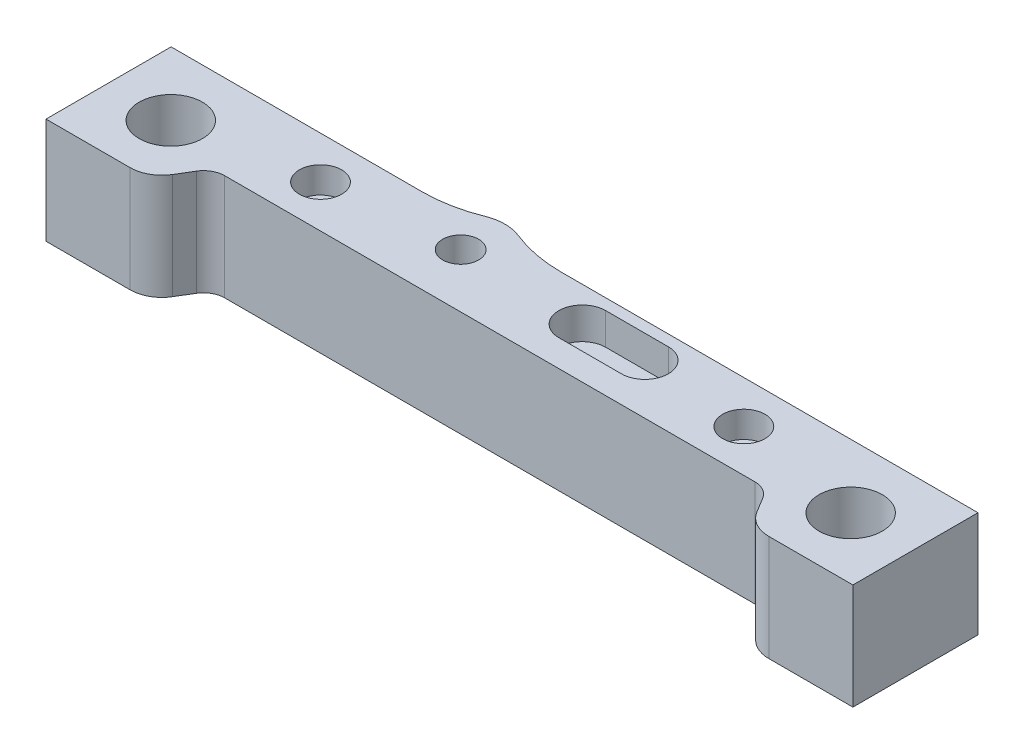
ISO-10303-21;
HEADER;
FILE_DESCRIPTION(('STEP AP214'),'2;1');
FILE_NAME('part.step','',(''),(''),'','','');
FILE_SCHEMA(('AUTOMOTIVE_DESIGN { 1 0 10303 214 1 1 1 1 }'));
ENDSEC;
DATA;
#1=APPLICATION_CONTEXT('core data for automotive mechanical design processes');
#2=APPLICATION_PROTOCOL_DEFINITION('international standard','automotive_design',2000,#1);
#3=PRODUCT_CONTEXT('',#1,'mechanical');
#4=PRODUCT('Part','Part','',(#3));
#5=PRODUCT_RELATED_PRODUCT_CATEGORY('part','',(#4));
#6=PRODUCT_DEFINITION_FORMATION('','',#4);
#7=PRODUCT_DEFINITION_CONTEXT('part definition',#1,'design');
#8=PRODUCT_DEFINITION('design','',#6,#7);
#9=PRODUCT_DEFINITION_SHAPE('','',#8);
#10=(LENGTH_UNIT() NAMED_UNIT(*) SI_UNIT(.MILLI.,.METRE.));
#11=(NAMED_UNIT(*) PLANE_ANGLE_UNIT() SI_UNIT($,.RADIAN.));
#12=(NAMED_UNIT(*) SI_UNIT($,.STERADIAN.) SOLID_ANGLE_UNIT());
#13=UNCERTAINTY_MEASURE_WITH_UNIT(LENGTH_MEASURE(1.E-05),#10,'distance_accuracy_value','');
#14=(GEOMETRIC_REPRESENTATION_CONTEXT(3) GLOBAL_UNCERTAINTY_ASSIGNED_CONTEXT((#13)) GLOBAL_UNIT_ASSIGNED_CONTEXT((#10,
#11,#12)) REPRESENTATION_CONTEXT('',''));
#15=CARTESIAN_POINT('',(0.,0.,0.));
#16=DIRECTION('',(0.,0.,1.));
#17=DIRECTION('',(1.,0.,0.));
#18=AXIS2_PLACEMENT_3D('',#15,#16,#17);
#19=CARTESIAN_POINT('',(20.,-13.5355339059327,-4.00499999999999));
#20=DIRECTION('',(0.,1.,0.));
#21=DIRECTION('',(0.,0.,1.));
#22=AXIS2_PLACEMENT_3D('',#19,#20,#21);
#23=CYLINDRICAL_SURFACE('',#22,1.25);
#24=CARTESIAN_POINT('',(20.,-2.48,-4.00499999999999));
#25=DIRECTION('',(0.,1.,0.));
#26=DIRECTION('',(0.,0.,1.));
#27=AXIS2_PLACEMENT_3D('',#24,#25,#26);
#28=CIRCLE('',#27,1.25);
#29=CARTESIAN_POINT('',(20.,-2.48,-2.75499999999999));
#30=VERTEX_POINT('',#29);
#31=EDGE_CURVE('E359',#30,#30,#28,.F.);
#32=ORIENTED_EDGE('',*,*,#31,.F.);
#33=EDGE_LOOP('',(#32));
#34=FACE_BOUND('',#33,.T.);
#35=CARTESIAN_POINT('',(20.,-7.2,-4.00499999999999));
#36=DIRECTION('',(0.,-1.,0.));
#37=DIRECTION('',(0.,0.,-1.));
#38=AXIS2_PLACEMENT_3D('',#35,#36,#37);
#39=CIRCLE('',#38,1.25);
#40=CARTESIAN_POINT('',(20.,-7.2,-5.25499999999999));
#41=VERTEX_POINT('',#40);
#42=EDGE_CURVE('E362',#41,#41,#39,.T.);
#43=ORIENTED_EDGE('',*,*,#42,.T.);
#44=EDGE_LOOP('',(#43));
#45=FACE_BOUND('',#44,.T.);
#46=ADVANCED_FACE('F38',(#34,#45),#23,.F.);
#47=CARTESIAN_POINT('',(0.,-10.,0.));
#48=DIRECTION('',(0.,1.,0.));
#49=DIRECTION('',(0.,0.,1.));
#50=AXIS2_PLACEMENT_3D('',#47,#48,#49);
#51=PLANE('',#50);
#52=CARTESIAN_POINT('',(20.,-10.,-4.00499999999999));
#53=DIRECTION('',(0.,-1.,0.));
#54=DIRECTION('',(0.,0.,-1.));
#55=AXIS2_PLACEMENT_3D('',#52,#53,#54);
#56=CIRCLE('',#55,2.725);
#57=CARTESIAN_POINT('',(20.,-10.,-6.72999999999999));
#58=VERTEX_POINT('',#57);
#59=EDGE_CURVE('E369',#58,#58,#56,.T.);
#60=ORIENTED_EDGE('',*,*,#59,.F.);
#61=EDGE_LOOP('',(#60));
#62=FACE_BOUND('',#61,.T.);
#63=CARTESIAN_POINT('',(-20.,-10.,-4.00499999999999));
#64=DIRECTION('',(0.,-1.,0.));
#65=DIRECTION('',(0.,0.,1.));
#66=AXIS2_PLACEMENT_3D('',#63,#64,#65);
#67=CIRCLE('',#66,2.725);
#68=CARTESIAN_POINT('',(-20.,-10.,-1.27999999999999));
#69=VERTEX_POINT('',#68);
#70=EDGE_CURVE('E374',#69,#69,#67,.T.);
#71=ORIENTED_EDGE('',*,*,#70,.F.);
#72=EDGE_LOOP('',(#71));
#73=FACE_BOUND('',#72,.T.);
#74=DIRECTION('',(-1.,0.,0.));
#75=VECTOR('',#74,1.);
#76=CARTESIAN_POINT('',(0.,-10.,3.80999999999997));
#77=LINE('',#76,#75);
#78=CARTESIAN_POINT('',(38.12,-10.,3.80999999999998));
#79=VERTEX_POINT('',#78);
#80=CARTESIAN_POINT('',(30.1715071075171,-10.,3.80999999999998));
#81=VERTEX_POINT('',#80);
#82=EDGE_CURVE('E263',#79,#81,#77,.T.);
#83=ORIENTED_EDGE('',*,*,#82,.T.);
#84=CARTESIAN_POINT('',(30.1715071075171,-10.,0.809999999999981));
#85=DIRECTION('',(0.,1.,0.));
#86=DIRECTION('',(0.,0.,1.));
#87=AXIS2_PLACEMENT_3D('',#84,#85,#86);
#88=CIRCLE('',#87,3.);
#89=CARTESIAN_POINT('',(27.6032012239419,-10.,2.36042087459919));
#90=VERTEX_POINT('',#89);
#91=EDGE_CURVE('E352',#81,#90,#88,.F.);
#92=ORIENTED_EDGE('',*,*,#91,.T.);
#93=DIRECTION('',(-0.516806958199737,0.,-0.856101961191735));
#94=VECTOR('',#93,1.);
#95=CARTESIAN_POINT('',(19.1863345718112,-10.,-11.5823017100173));
#96=LINE('',#95,#94);
#97=CARTESIAN_POINT('',(26.7616579117905,-10.,0.966386083600518));
#98=VERTEX_POINT('',#97);
#99=EDGE_CURVE('E261',#90,#98,#96,.T.);
#100=ORIENTED_EDGE('',*,*,#99,.T.);
#101=CARTESIAN_POINT('',(25.049453989407,-10.,1.99999999999999));
#102=DIRECTION('',(0.,1.,0.));
#103=DIRECTION('',(0.,0.,1.));
#104=AXIS2_PLACEMENT_3D('',#101,#102,#103);
#105=CIRCLE('',#104,2.);
#106=CARTESIAN_POINT('',(25.049453989407,-10.,0.));
#107=VERTEX_POINT('',#106);
#108=EDGE_CURVE('E336',#98,#107,#105,.T.);
#109=ORIENTED_EDGE('',*,*,#108,.T.);
#110=DIRECTION('',(-1.,0.,0.));
#111=VECTOR('',#110,1.);
#112=CARTESIAN_POINT('',(0.,-10.,0.));
#113=LINE('',#112,#111);
#114=CARTESIAN_POINT('',(-25.049453989407,-10.,0.));
#115=VERTEX_POINT('',#114);
#116=EDGE_CURVE('E258',#107,#115,#113,.T.);
#117=ORIENTED_EDGE('',*,*,#116,.T.);
#118=CARTESIAN_POINT('',(-25.049453989407,-10.,2.00000000000001));
#119=DIRECTION('',(0.,1.,0.));
#120=DIRECTION('',(0.,0.,1.));
#121=AXIS2_PLACEMENT_3D('',#118,#119,#120);
#122=CIRCLE('',#121,2.);
#123=CARTESIAN_POINT('',(-26.7616579117905,-10.,0.966386083600536));
#124=VERTEX_POINT('',#123);
#125=EDGE_CURVE('E340',#115,#124,#122,.T.);
#126=ORIENTED_EDGE('',*,*,#125,.T.);
#127=DIRECTION('',(-0.516806958199737,0.,0.856101961191735));
#128=VECTOR('',#127,1.);
#129=CARTESIAN_POINT('',(-19.1863345718112,-10.,-11.5823017100173));
#130=LINE('',#129,#128);
#131=CARTESIAN_POINT('',(-27.6032012239419,-10.,2.36042087459921));
#132=VERTEX_POINT('',#131);
#133=EDGE_CURVE('E256',#124,#132,#130,.T.);
#134=ORIENTED_EDGE('',*,*,#133,.T.);
#135=CARTESIAN_POINT('',(-30.1715071075171,-10.,0.809999999999999));
#136=DIRECTION('',(0.,1.,0.));
#137=DIRECTION('',(0.,0.,1.));
#138=AXIS2_PLACEMENT_3D('',#135,#136,#137);
#139=CIRCLE('',#138,3.);
#140=CARTESIAN_POINT('',(-30.1715071075171,-10.,3.81));
#141=VERTEX_POINT('',#140);
#142=EDGE_CURVE('E63',#132,#141,#139,.F.);
#143=ORIENTED_EDGE('',*,*,#142,.T.);
#144=DIRECTION('',(-1.,0.,0.));
#145=VECTOR('',#144,1.);
#146=CARTESIAN_POINT('',(0.,-10.,3.80999999999997));
#147=LINE('',#146,#145);
#148=CARTESIAN_POINT('',(-38.12,-10.,3.81000000000001));
#149=VERTEX_POINT('',#148);
#150=EDGE_CURVE('E254',#141,#149,#147,.T.);
#151=ORIENTED_EDGE('',*,*,#150,.T.);
#152=DIRECTION('',(0.,0.,-1.));
#153=VECTOR('',#152,1.);
#154=CARTESIAN_POINT('',(-38.12,-10.,0.));
#155=LINE('',#154,#153);
#156=CARTESIAN_POINT('',(-38.12,-10.,-8.01));
#157=VERTEX_POINT('',#156);
#158=EDGE_CURVE('E252',#149,#157,#155,.T.);
#159=ORIENTED_EDGE('',*,*,#158,.T.);
#160=DIRECTION('',(1.,0.,0.));
#161=VECTOR('',#160,1.);
#162=CARTESIAN_POINT('',(0.,-10.,-8.00999999999999));
#163=LINE('',#162,#161);
#164=CARTESIAN_POINT('',(-14.4092450938548,-10.,-8.00999999999999));
#165=VERTEX_POINT('',#164);
#166=EDGE_CURVE('E250',#157,#165,#163,.T.);
#167=ORIENTED_EDGE('',*,*,#166,.T.);
#168=CARTESIAN_POINT('',(-14.4092450938548,-10.,-21.4073898813991));
#169=DIRECTION('',(0.,1.,0.));
#170=DIRECTION('',(0.,0.,1.));
#171=AXIS2_PLACEMENT_3D('',#168,#169,#170);
#172=CIRCLE('',#171,13.3973898813991);
#173=CARTESIAN_POINT('',(-9.40924509385477,-10.,-8.97798701423709));
#174=VERTEX_POINT('',#173);
#175=EDGE_CURVE('E246',#174,#165,#172,.F.);
#176=ORIENTED_EDGE('',*,*,#175,.F.);
#177=CARTESIAN_POINT('',(-7.84923973572024,-10.,-5.09999999999999));
#178=DIRECTION('',(0.,1.,0.));
#179=DIRECTION('',(0.,0.,1.));
#180=AXIS2_PLACEMENT_3D('',#177,#178,#179);
#181=CIRCLE('',#180,4.18);
#182=CARTESIAN_POINT('',(-6.2892343775857,-10.,-8.97798701423709));
#183=VERTEX_POINT('',#182);
#184=EDGE_CURVE('E243',#174,#183,#181,.F.);
#185=ORIENTED_EDGE('',*,*,#184,.T.);
#186=CARTESIAN_POINT('',(-1.28923437758571,-10.,-21.4073898813991));
#187=DIRECTION('',(0.,1.,0.));
#188=DIRECTION('',(0.,0.,1.));
#189=AXIS2_PLACEMENT_3D('',#186,#187,#188);
#190=CIRCLE('',#189,13.3973898813991);
#191=CARTESIAN_POINT('',(-1.28923437758571,-10.,-8.00999999999999));
#192=VERTEX_POINT('',#191);
#193=EDGE_CURVE('E270',#183,#192,#190,.T.);
#194=ORIENTED_EDGE('',*,*,#193,.T.);
#195=DIRECTION('',(1.,0.,0.));
#196=VECTOR('',#195,1.);
#197=CARTESIAN_POINT('',(0.,-10.,-8.00999999999999));
#198=LINE('',#197,#196);
#199=CARTESIAN_POINT('',(38.12,-10.,-8.01000000000002));
#200=VERTEX_POINT('',#199);
#201=EDGE_CURVE('E268',#192,#200,#198,.T.);
#202=ORIENTED_EDGE('',*,*,#201,.T.);
#203=DIRECTION('',(0.,0.,1.));
#204=VECTOR('',#203,1.);
#205=CARTESIAN_POINT('',(38.12,-10.,0.));
#206=LINE('',#205,#204);
#207=EDGE_CURVE('E266',#200,#79,#206,.T.);
#208=ORIENTED_EDGE('',*,*,#207,.T.);
#209=EDGE_LOOP('',(#83,#92,#100,#109,#117,#126,#134,#143,#151,#159,#167,#176,#185,#194,#202,#208));
#210=FACE_BOUND('',#209,.T.);
#211=CARTESIAN_POINT('',(-7.84923973572024,-10.,-5.09999999999999));
#212=DIRECTION('',(0.,1.,0.));
#213=DIRECTION('',(0.,0.,1.));
#214=AXIS2_PLACEMENT_3D('',#211,#212,#213);
#215=CIRCLE('',#214,1.7);
#216=CARTESIAN_POINT('',(-7.84923973572024,-10.,-3.39999999999999));
#217=VERTEX_POINT('',#216);
#218=EDGE_CURVE('E203',#217,#217,#215,.F.);
#219=ORIENTED_EDGE('',*,*,#218,.F.);
#220=EDGE_LOOP('',(#219));
#221=FACE_BOUND('',#220,.T.);
#222=ADVANCED_FACE('F389',(#62,#73,#210,#221),#51,.F.);
#223=CARTESIAN_POINT('',(0.,0.,0.));
#224=DIRECTION('',(0.,1.,0.));
#225=DIRECTION('',(0.,0.,1.));
#226=AXIS2_PLACEMENT_3D('',#223,#224,#225);
#227=PLANE('',#226);
#228=CARTESIAN_POINT('',(-7.84923973572024,0.,-5.09999999999999));
#229=DIRECTION('',(0.,1.,0.));
#230=DIRECTION('',(0.,0.,1.));
#231=AXIS2_PLACEMENT_3D('',#228,#229,#230);
#232=CIRCLE('',#231,1.7);
#233=CARTESIAN_POINT('',(-7.84923973572024,0.,-3.39999999999999));
#234=VERTEX_POINT('',#233);
#235=EDGE_CURVE('E361',#234,#234,#232,.T.);
#236=ORIENTED_EDGE('',*,*,#235,.F.);
#237=EDGE_LOOP('',(#236));
#238=FACE_BOUND('',#237,.T.);
#239=DIRECTION('',(1.,0.,0.));
#240=VECTOR('',#239,1.);
#241=CARTESIAN_POINT('',(0.,0.,-2.52999999999999));
#242=LINE('',#241,#240);
#243=CARTESIAN_POINT('',(3.99210502631991,0.,-2.52999999999999));
#244=VERTEX_POINT('',#243);
#245=CARTESIAN_POINT('',(9.91210502631991,0.,-2.52999999999999));
#246=VERTEX_POINT('',#245);
#247=EDGE_CURVE('E55',#244,#246,#242,.T.);
#248=ORIENTED_EDGE('',*,*,#247,.F.);
#249=CARTESIAN_POINT('',(3.99210502631991,0.,-4.74499999999999));
#250=DIRECTION('',(0.,1.,0.));
#251=DIRECTION('',(0.,0.,1.));
#252=AXIS2_PLACEMENT_3D('',#249,#250,#251);
#253=CIRCLE('',#252,2.215);
#254=CARTESIAN_POINT('',(3.99210502631991,0.,-6.95999999999999));
#255=VERTEX_POINT('',#254);
#256=EDGE_CURVE('E197',#255,#244,#253,.T.);
#257=ORIENTED_EDGE('',*,*,#256,.F.);
#258=DIRECTION('',(1.,0.,0.));
#259=VECTOR('',#258,1.);
#260=CARTESIAN_POINT('',(0.,0.,-6.95999999999999));
#261=LINE('',#260,#259);
#262=CARTESIAN_POINT('',(9.91210502631991,0.,-6.95999999999999));
#263=VERTEX_POINT('',#262);
#264=EDGE_CURVE('E200',#255,#263,#261,.T.);
#265=ORIENTED_EDGE('',*,*,#264,.T.);
#266=CARTESIAN_POINT('',(9.91210502631991,0.,-4.74499999999999));
#267=DIRECTION('',(0.,1.,0.));
#268=DIRECTION('',(0.,0.,1.));
#269=AXIS2_PLACEMENT_3D('',#266,#267,#268);
#270=CIRCLE('',#269,2.215);
#271=EDGE_CURVE('E209',#246,#263,#270,.T.);
#272=ORIENTED_EDGE('',*,*,#271,.F.);
#273=EDGE_LOOP('',(#248,#257,#265,#272));
#274=FACE_BOUND('',#273,.T.);
#275=CARTESIAN_POINT('',(20.,0.,-4.00499999999999));
#276=DIRECTION('',(0.,1.,0.));
#277=DIRECTION('',(0.,0.,1.));
#278=AXIS2_PLACEMENT_3D('',#275,#276,#277);
#279=CIRCLE('',#278,2.);
#280=CARTESIAN_POINT('',(20.,0.,-2.00499999999999));
#281=VERTEX_POINT('',#280);
#282=EDGE_CURVE('E215',#281,#281,#279,.F.);
#283=ORIENTED_EDGE('',*,*,#282,.T.);
#284=EDGE_LOOP('',(#283));
#285=FACE_BOUND('',#284,.T.);
#286=DIRECTION('',(-0.516806958199737,0.,-0.856101961191735));
#287=VECTOR('',#286,1.);
#288=CARTESIAN_POINT('',(19.1863345718112,0.,-11.5823017100173));
#289=LINE('',#288,#287);
#290=CARTESIAN_POINT('',(27.6032012239419,0.,2.36042087459919));
#291=VERTEX_POINT('',#290);
#292=CARTESIAN_POINT('',(26.7616579117905,0.,0.966386083600518));
#293=VERTEX_POINT('',#292);
#294=EDGE_CURVE('E291',#291,#293,#289,.T.);
#295=ORIENTED_EDGE('',*,*,#294,.F.);
#296=CARTESIAN_POINT('',(30.1715071075171,0.,0.809999999999981));
#297=DIRECTION('',(0.,1.,0.));
#298=DIRECTION('',(0.,0.,1.));
#299=AXIS2_PLACEMENT_3D('',#296,#297,#298);
#300=CIRCLE('',#299,3.);
#301=CARTESIAN_POINT('',(30.1715071075171,0.,3.80999999999998));
#302=VERTEX_POINT('',#301);
#303=EDGE_CURVE('E347',#291,#302,#300,.T.);
#304=ORIENTED_EDGE('',*,*,#303,.T.);
#305=DIRECTION('',(-1.,0.,0.));
#306=VECTOR('',#305,1.);
#307=CARTESIAN_POINT('',(0.,0.,3.80999999999997));
#308=LINE('',#307,#306);
#309=CARTESIAN_POINT('',(38.12,0.,3.80999999999998));
#310=VERTEX_POINT('',#309);
#311=EDGE_CURVE('E293',#310,#302,#308,.T.);
#312=ORIENTED_EDGE('',*,*,#311,.F.);
#313=DIRECTION('',(0.,0.,1.));
#314=VECTOR('',#313,1.);
#315=CARTESIAN_POINT('',(38.12,0.,0.));
#316=LINE('',#315,#314);
#317=CARTESIAN_POINT('',(38.12,0.,-8.01000000000002));
#318=VERTEX_POINT('',#317);
#319=EDGE_CURVE('E296',#318,#310,#316,.T.);
#320=ORIENTED_EDGE('',*,*,#319,.F.);
#321=DIRECTION('',(1.,0.,0.));
#322=VECTOR('',#321,1.);
#323=CARTESIAN_POINT('',(0.,0.,-8.00999999999999));
#324=LINE('',#323,#322);
#325=CARTESIAN_POINT('',(-1.28923437758571,0.,-8.00999999999999));
#326=VERTEX_POINT('',#325);
#327=EDGE_CURVE('E298',#326,#318,#324,.T.);
#328=ORIENTED_EDGE('',*,*,#327,.F.);
#329=CARTESIAN_POINT('',(-1.28923437758571,0.,-21.4073898813991));
#330=DIRECTION('',(0.,1.,0.));
#331=DIRECTION('',(0.,0.,1.));
#332=AXIS2_PLACEMENT_3D('',#329,#330,#331);
#333=CIRCLE('',#332,13.3973898813991);
#334=CARTESIAN_POINT('',(-6.2892343775857,0.,-8.97798701423709));
#335=VERTEX_POINT('',#334);
#336=EDGE_CURVE('E247',#335,#326,#333,.T.);
#337=ORIENTED_EDGE('',*,*,#336,.F.);
#338=CARTESIAN_POINT('',(-7.84923973572024,0.,-5.09999999999999));
#339=DIRECTION('',(0.,1.,0.));
#340=DIRECTION('',(0.,0.,1.));
#341=AXIS2_PLACEMENT_3D('',#338,#339,#340);
#342=CIRCLE('',#341,4.18);
#343=CARTESIAN_POINT('',(-9.40924509385477,0.,-8.97798701423709));
#344=VERTEX_POINT('',#343);
#345=EDGE_CURVE('E234',#344,#335,#342,.F.);
#346=ORIENTED_EDGE('',*,*,#345,.F.);
#347=CARTESIAN_POINT('',(-14.4092450938548,0.,-21.4073898813991));
#348=DIRECTION('',(0.,1.,0.));
#349=DIRECTION('',(0.,0.,1.));
#350=AXIS2_PLACEMENT_3D('',#347,#348,#349);
#351=CIRCLE('',#350,13.3973898813991);
#352=CARTESIAN_POINT('',(-14.4092450938548,0.,-8.00999999999999));
#353=VERTEX_POINT('',#352);
#354=EDGE_CURVE('E275',#344,#353,#351,.F.);
#355=ORIENTED_EDGE('',*,*,#354,.T.);
#356=DIRECTION('',(1.,0.,0.));
#357=VECTOR('',#356,1.);
#358=CARTESIAN_POINT('',(0.,0.,-8.00999999999999));
#359=LINE('',#358,#357);
#360=CARTESIAN_POINT('',(-38.12,0.,-8.01));
#361=VERTEX_POINT('',#360);
#362=EDGE_CURVE('E278',#361,#353,#359,.T.);
#363=ORIENTED_EDGE('',*,*,#362,.F.);
#364=DIRECTION('',(0.,0.,-1.));
#365=VECTOR('',#364,1.);
#366=CARTESIAN_POINT('',(-38.12,0.,0.));
#367=LINE('',#366,#365);
#368=CARTESIAN_POINT('',(-38.12,0.,3.81000000000001));
#369=VERTEX_POINT('',#368);
#370=EDGE_CURVE('E281',#369,#361,#367,.T.);
#371=ORIENTED_EDGE('',*,*,#370,.F.);
#372=DIRECTION('',(-1.,0.,0.));
#373=VECTOR('',#372,1.);
#374=CARTESIAN_POINT('',(0.,0.,3.80999999999997));
#375=LINE('',#374,#373);
#376=CARTESIAN_POINT('',(-30.1715071075171,0.,3.81));
#377=VERTEX_POINT('',#376);
#378=EDGE_CURVE('E283',#377,#369,#375,.T.);
#379=ORIENTED_EDGE('',*,*,#378,.F.);
#380=CARTESIAN_POINT('',(-30.1715071075171,0.,0.809999999999999));
#381=DIRECTION('',(0.,1.,0.));
#382=DIRECTION('',(0.,0.,1.));
#383=AXIS2_PLACEMENT_3D('',#380,#381,#382);
#384=CIRCLE('',#383,3.);
#385=CARTESIAN_POINT('',(-27.6032012239419,0.,2.36042087459921));
#386=VERTEX_POINT('',#385);
#387=EDGE_CURVE('E345',#377,#386,#384,.T.);
#388=ORIENTED_EDGE('',*,*,#387,.T.);
#389=DIRECTION('',(-0.516806958199737,0.,0.856101961191735));
#390=VECTOR('',#389,1.);
#391=CARTESIAN_POINT('',(-19.1863345718112,0.,-11.5823017100173));
#392=LINE('',#391,#390);
#393=CARTESIAN_POINT('',(-26.7616579117905,0.,0.966386083600536));
#394=VERTEX_POINT('',#393);
#395=EDGE_CURVE('E285',#394,#386,#392,.T.);
#396=ORIENTED_EDGE('',*,*,#395,.F.);
#397=CARTESIAN_POINT('',(-25.049453989407,0.,2.00000000000001));
#398=DIRECTION('',(0.,1.,0.));
#399=DIRECTION('',(0.,0.,1.));
#400=AXIS2_PLACEMENT_3D('',#397,#398,#399);
#401=CIRCLE('',#400,2.);
#402=CARTESIAN_POINT('',(-25.049453989407,0.,0.));
#403=VERTEX_POINT('',#402);
#404=EDGE_CURVE('E338',#394,#403,#401,.F.);
#405=ORIENTED_EDGE('',*,*,#404,.T.);
#406=DIRECTION('',(-1.,0.,0.));
#407=VECTOR('',#406,1.);
#408=CARTESIAN_POINT('',(0.,0.,0.));
#409=LINE('',#408,#407);
#410=CARTESIAN_POINT('',(25.049453989407,0.,0.));
#411=VERTEX_POINT('',#410);
#412=EDGE_CURVE('E288',#411,#403,#409,.T.);
#413=ORIENTED_EDGE('',*,*,#412,.F.);
#414=CARTESIAN_POINT('',(25.049453989407,0.,1.99999999999999));
#415=DIRECTION('',(0.,1.,0.));
#416=DIRECTION('',(0.,0.,1.));
#417=AXIS2_PLACEMENT_3D('',#414,#415,#416);
#418=CIRCLE('',#417,2.);
#419=EDGE_CURVE('E333',#411,#293,#418,.F.);
#420=ORIENTED_EDGE('',*,*,#419,.T.);
#421=EDGE_LOOP('',(#295,#304,#312,#320,#328,#337,#346,#355,#363,#371,#379,#388,#396,#405,#413,#420));
#422=FACE_BOUND('',#421,.T.);
#423=CARTESIAN_POINT('',(-32.12,0.,-1.98));
#424=DIRECTION('',(0.,1.,0.));
#425=DIRECTION('',(0.,0.,1.));
#426=AXIS2_PLACEMENT_3D('',#423,#424,#425);
#427=CIRCLE('',#426,2.99);
#428=CARTESIAN_POINT('',(-32.12,0.,1.01));
#429=VERTEX_POINT('',#428);
#430=EDGE_CURVE('E238',#429,#429,#427,.T.);
#431=ORIENTED_EDGE('',*,*,#430,.F.);
#432=EDGE_LOOP('',(#431));
#433=FACE_BOUND('',#432,.T.);
#434=CARTESIAN_POINT('',(32.12,0.,-1.98));
#435=DIRECTION('',(0.,1.,0.));
#436=DIRECTION('',(0.,0.,1.));
#437=AXIS2_PLACEMENT_3D('',#434,#435,#436);
#438=CIRCLE('',#437,2.99);
#439=CARTESIAN_POINT('',(32.12,0.,1.01));
#440=VERTEX_POINT('',#439);
#441=EDGE_CURVE('E235',#440,#440,#438,.F.);
#442=ORIENTED_EDGE('',*,*,#441,.T.);
#443=EDGE_LOOP('',(#442));
#444=FACE_BOUND('',#443,.T.);
#445=CARTESIAN_POINT('',(-20.,0.,-4.00499999999999));
#446=DIRECTION('',(0.,1.,0.));
#447=DIRECTION('',(0.,0.,1.));
#448=AXIS2_PLACEMENT_3D('',#445,#446,#447);
#449=CIRCLE('',#448,2.);
#450=CARTESIAN_POINT('',(-20.,0.,-2.00499999999999));
#451=VERTEX_POINT('',#450);
#452=EDGE_CURVE('E223',#451,#451,#449,.T.);
#453=ORIENTED_EDGE('',*,*,#452,.F.);
#454=EDGE_LOOP('',(#453));
#455=FACE_BOUND('',#454,.T.);
#456=ADVANCED_FACE('F391',(#238,#274,#285,#422,#433,#444,#455),#227,.T.);
#457=CARTESIAN_POINT('',(-7.84923973572024,-10.,-5.09999999999999));
#458=DIRECTION('',(0.,1.,0.));
#459=DIRECTION('',(0.,0.,1.));
#460=AXIS2_PLACEMENT_3D('',#457,#458,#459);
#461=CYLINDRICAL_SURFACE('',#460,4.18);
#462=ORIENTED_EDGE('',*,*,#345,.T.);
#463=DIRECTION('',(0.,1.,0.));
#464=VECTOR('',#463,1.);
#465=CARTESIAN_POINT('',(-6.2892343775857,-10.,-8.97798701423709));
#466=LINE('',#465,#464);
#467=EDGE_CURVE('E301',#183,#335,#466,.T.);
#468=ORIENTED_EDGE('',*,*,#467,.F.);
#469=ORIENTED_EDGE('',*,*,#184,.F.);
#470=DIRECTION('',(0.,1.,0.));
#471=VECTOR('',#470,1.);
#472=CARTESIAN_POINT('',(-9.40924509385477,-10.,-8.97798701423709));
#473=LINE('',#472,#471);
#474=EDGE_CURVE('E272',#174,#344,#473,.T.);
#475=ORIENTED_EDGE('',*,*,#474,.T.);
#476=EDGE_LOOP('',(#462,#468,#469,#475));
#477=FACE_BOUND('',#476,.T.);
#478=ADVANCED_FACE('F398',(#477),#461,.T.);
#479=CARTESIAN_POINT('',(-1.28923437758571,-10.,-21.4073898813991));
#480=DIRECTION('',(0.,1.,0.));
#481=DIRECTION('',(0.,0.,1.));
#482=AXIS2_PLACEMENT_3D('',#479,#480,#481);
#483=CYLINDRICAL_SURFACE('',#482,13.3973898813991);
#484=ORIENTED_EDGE('',*,*,#336,.T.);
#485=DIRECTION('',(0.,1.,0.));
#486=VECTOR('',#485,1.);
#487=CARTESIAN_POINT('',(-1.28923437758571,-10.,-8.00999999999999));
#488=LINE('',#487,#486);
#489=EDGE_CURVE('E305',#192,#326,#488,.T.);
#490=ORIENTED_EDGE('',*,*,#489,.F.);
#491=ORIENTED_EDGE('',*,*,#193,.F.);
#492=ORIENTED_EDGE('',*,*,#467,.T.);
#493=EDGE_LOOP('',(#484,#490,#491,#492));
#494=FACE_BOUND('',#493,.T.);
#495=ADVANCED_FACE('F409',(#494),#483,.F.);
#496=CARTESIAN_POINT('',(0.,-10.,-8.00999999999999));
#497=DIRECTION('',(0.,0.,1.));
#498=DIRECTION('',(1.,0.,0.));
#499=AXIS2_PLACEMENT_3D('',#496,#497,#498);
#500=PLANE('',#499);
#501=ORIENTED_EDGE('',*,*,#327,.T.);
#502=DIRECTION('',(0.,1.,0.));
#503=VECTOR('',#502,1.);
#504=CARTESIAN_POINT('',(38.12,-10.,-8.01000000000002));
#505=LINE('',#504,#503);
#506=EDGE_CURVE('E308',#200,#318,#505,.T.);
#507=ORIENTED_EDGE('',*,*,#506,.F.);
#508=ORIENTED_EDGE('',*,*,#201,.F.);
#509=ORIENTED_EDGE('',*,*,#489,.T.);
#510=EDGE_LOOP('',(#501,#507,#508,#509));
#511=FACE_BOUND('',#510,.T.);
#512=ADVANCED_FACE('F412',(#511),#500,.F.);
#513=CARTESIAN_POINT('',(38.12,-10.,0.));
#514=DIRECTION('',(-1.,0.,0.));
#515=DIRECTION('',(0.,0.,1.));
#516=AXIS2_PLACEMENT_3D('',#513,#514,#515);
#517=PLANE('',#516);
#518=ORIENTED_EDGE('',*,*,#319,.T.);
#519=DIRECTION('',(0.,1.,0.));
#520=VECTOR('',#519,1.);
#521=CARTESIAN_POINT('',(38.12,-10.,3.80999999999998));
#522=LINE('',#521,#520);
#523=EDGE_CURVE('E311',#79,#310,#522,.T.);
#524=ORIENTED_EDGE('',*,*,#523,.F.);
#525=ORIENTED_EDGE('',*,*,#207,.F.);
#526=ORIENTED_EDGE('',*,*,#506,.T.);
#527=EDGE_LOOP('',(#518,#524,#525,#526));
#528=FACE_BOUND('',#527,.T.);
#529=ADVANCED_FACE('F416',(#528),#517,.F.);
#530=CARTESIAN_POINT('',(0.,-10.,3.80999999999997));
#531=DIRECTION('',(0.,0.,-1.));
#532=DIRECTION('',(-1.,0.,0.));
#533=AXIS2_PLACEMENT_3D('',#530,#531,#532);
#534=PLANE('',#533);
#535=ORIENTED_EDGE('',*,*,#311,.T.);
#536=DIRECTION('',(0.,1.,0.));
#537=VECTOR('',#536,1.);
#538=CARTESIAN_POINT('',(30.1715071075171,-10.,3.80999999999998));
#539=LINE('',#538,#537);
#540=EDGE_CURVE('E349',#302,#81,#539,.F.);
#541=ORIENTED_EDGE('',*,*,#540,.T.);
#542=ORIENTED_EDGE('',*,*,#82,.F.);
#543=ORIENTED_EDGE('',*,*,#523,.T.);
#544=EDGE_LOOP('',(#535,#541,#542,#543));
#545=FACE_BOUND('',#544,.T.);
#546=ADVANCED_FACE('F420',(#545),#534,.F.);
#547=CARTESIAN_POINT('',(19.1863345718112,-10.,-11.5823017100173));
#548=DIRECTION('',(0.856101961191735,0.,-0.516806958199737));
#549=DIRECTION('',(-0.516806958199737,0.,-0.856101961191735));
#550=AXIS2_PLACEMENT_3D('',#547,#548,#549);
#551=PLANE('',#550);
#552=ORIENTED_EDGE('',*,*,#99,.F.);
#553=DIRECTION('',(0.,1.,0.));
#554=VECTOR('',#553,1.);
#555=CARTESIAN_POINT('',(27.6032012239419,-10.,2.36042087459919));
#556=LINE('',#555,#554);
#557=EDGE_CURVE('E342',#90,#291,#556,.T.);
#558=ORIENTED_EDGE('',*,*,#557,.T.);
#559=ORIENTED_EDGE('',*,*,#294,.T.);
#560=DIRECTION('',(0.,1.,0.));
#561=VECTOR('',#560,1.);
#562=CARTESIAN_POINT('',(26.7616579117905,-10.,0.96638608360052));
#563=LINE('',#562,#561);
#564=EDGE_CURVE('E327',#293,#98,#563,.F.);
#565=ORIENTED_EDGE('',*,*,#564,.T.);
#566=EDGE_LOOP('',(#552,#558,#559,#565));
#567=FACE_BOUND('',#566,.T.);
#568=ADVANCED_FACE('F424',(#567),#551,.F.);
#569=CARTESIAN_POINT('',(0.,-10.,0.));
#570=DIRECTION('',(0.,0.,-1.));
#571=DIRECTION('',(-1.,0.,0.));
#572=AXIS2_PLACEMENT_3D('',#569,#570,#571);
#573=PLANE('',#572);
#574=ORIENTED_EDGE('',*,*,#116,.F.);
#575=DIRECTION('',(0.,1.,0.));
#576=VECTOR('',#575,1.);
#577=CARTESIAN_POINT('',(25.049453989407,0.,0.));
#578=LINE('',#577,#576);
#579=EDGE_CURVE('E324',#107,#411,#578,.T.);
#580=ORIENTED_EDGE('',*,*,#579,.T.);
#581=ORIENTED_EDGE('',*,*,#412,.T.);
#582=DIRECTION('',(0.,1.,0.));
#583=VECTOR('',#582,1.);
#584=CARTESIAN_POINT('',(-25.049453989407,-10.,0.));
#585=LINE('',#584,#583);
#586=EDGE_CURVE('E304',#403,#115,#585,.F.);
#587=ORIENTED_EDGE('',*,*,#586,.T.);
#588=EDGE_LOOP('',(#574,#580,#581,#587));
#589=FACE_BOUND('',#588,.T.);
#590=ADVANCED_FACE('F428',(#589),#573,.F.);
#591=CARTESIAN_POINT('',(-19.1863345718112,-10.,-11.5823017100173));
#592=DIRECTION('',(-0.856101961191735,0.,-0.516806958199737));
#593=DIRECTION('',(-0.516806958199737,0.,0.856101961191735));
#594=AXIS2_PLACEMENT_3D('',#591,#592,#593);
#595=PLANE('',#594);
#596=ORIENTED_EDGE('',*,*,#395,.T.);
#597=DIRECTION('',(0.,1.,0.));
#598=VECTOR('',#597,1.);
#599=CARTESIAN_POINT('',(-27.6032012239419,-10.,2.36042087459921));
#600=LINE('',#599,#598);
#601=EDGE_CURVE('E11',#386,#132,#600,.F.);
#602=ORIENTED_EDGE('',*,*,#601,.T.);
#603=ORIENTED_EDGE('',*,*,#133,.F.);
#604=DIRECTION('',(0.,1.,0.));
#605=VECTOR('',#604,1.);
#606=CARTESIAN_POINT('',(-26.7616579117905,0.,0.966386083600533));
#607=LINE('',#606,#605);
#608=EDGE_CURVE('E330',#124,#394,#607,.T.);
#609=ORIENTED_EDGE('',*,*,#608,.T.);
#610=EDGE_LOOP('',(#596,#602,#603,#609));
#611=FACE_BOUND('',#610,.T.);
#612=ADVANCED_FACE('F432',(#611),#595,.F.);
#613=CARTESIAN_POINT('',(0.,-10.,3.80999999999997));
#614=DIRECTION('',(0.,0.,-1.));
#615=DIRECTION('',(-1.,0.,0.));
#616=AXIS2_PLACEMENT_3D('',#613,#614,#615);
#617=PLANE('',#616);
#618=ORIENTED_EDGE('',*,*,#150,.F.);
#619=DIRECTION('',(0.,1.,0.));
#620=VECTOR('',#619,1.);
#621=CARTESIAN_POINT('',(-30.1715071075171,-10.,3.81));
#622=LINE('',#621,#620);
#623=EDGE_CURVE('E47',#141,#377,#622,.T.);
#624=ORIENTED_EDGE('',*,*,#623,.T.);
#625=ORIENTED_EDGE('',*,*,#378,.T.);
#626=DIRECTION('',(0.,1.,0.));
#627=VECTOR('',#626,1.);
#628=CARTESIAN_POINT('',(-38.12,-10.,3.81000000000001));
#629=LINE('',#628,#627);
#630=EDGE_CURVE('E314',#149,#369,#629,.T.);
#631=ORIENTED_EDGE('',*,*,#630,.F.);
#632=EDGE_LOOP('',(#618,#624,#625,#631));
#633=FACE_BOUND('',#632,.T.);
#634=ADVANCED_FACE('F436',(#633),#617,.F.);
#635=CARTESIAN_POINT('',(-38.12,-10.,0.));
#636=DIRECTION('',(1.,0.,0.));
#637=DIRECTION('',(0.,0.,-1.));
#638=AXIS2_PLACEMENT_3D('',#635,#636,#637);
#639=PLANE('',#638);
#640=ORIENTED_EDGE('',*,*,#370,.T.);
#641=DIRECTION('',(0.,1.,0.));
#642=VECTOR('',#641,1.);
#643=CARTESIAN_POINT('',(-38.12,-10.,-8.01));
#644=LINE('',#643,#642);
#645=EDGE_CURVE('E317',#157,#361,#644,.T.);
#646=ORIENTED_EDGE('',*,*,#645,.F.);
#647=ORIENTED_EDGE('',*,*,#158,.F.);
#648=ORIENTED_EDGE('',*,*,#630,.T.);
#649=EDGE_LOOP('',(#640,#646,#647,#648));
#650=FACE_BOUND('',#649,.T.);
#651=ADVANCED_FACE('F440',(#650),#639,.F.);
#652=CARTESIAN_POINT('',(0.,-10.,-8.00999999999999));
#653=DIRECTION('',(0.,0.,1.));
#654=DIRECTION('',(1.,0.,0.));
#655=AXIS2_PLACEMENT_3D('',#652,#653,#654);
#656=PLANE('',#655);
#657=ORIENTED_EDGE('',*,*,#362,.T.);
#658=DIRECTION('',(0.,1.,0.));
#659=VECTOR('',#658,1.);
#660=CARTESIAN_POINT('',(-14.4092450938548,-10.,-8.00999999999999));
#661=LINE('',#660,#659);
#662=EDGE_CURVE('E320',#165,#353,#661,.T.);
#663=ORIENTED_EDGE('',*,*,#662,.F.);
#664=ORIENTED_EDGE('',*,*,#166,.F.);
#665=ORIENTED_EDGE('',*,*,#645,.T.);
#666=EDGE_LOOP('',(#657,#663,#664,#665));
#667=FACE_BOUND('',#666,.T.);
#668=ADVANCED_FACE('F444',(#667),#656,.F.);
#669=CARTESIAN_POINT('',(-14.4092450938548,-10.,-21.4073898813991));
#670=DIRECTION('',(0.,1.,0.));
#671=DIRECTION('',(0.,0.,1.));
#672=AXIS2_PLACEMENT_3D('',#669,#670,#671);
#673=CYLINDRICAL_SURFACE('',#672,13.3973898813991);
#674=ORIENTED_EDGE('',*,*,#354,.F.);
#675=ORIENTED_EDGE('',*,*,#474,.F.);
#676=ORIENTED_EDGE('',*,*,#175,.T.);
#677=ORIENTED_EDGE('',*,*,#662,.T.);
#678=EDGE_LOOP('',(#674,#675,#676,#677));
#679=FACE_BOUND('',#678,.T.);
#680=ADVANCED_FACE('F448',(#679),#673,.F.);
#681=CARTESIAN_POINT('',(25.049453989407,-10.,1.99999999999999));
#682=DIRECTION('',(0.,-1.,0.));
#683=DIRECTION('',(0.,0.,-1.));
#684=AXIS2_PLACEMENT_3D('',#681,#682,#683);
#685=CYLINDRICAL_SURFACE('',#684,2.);
#686=ORIENTED_EDGE('',*,*,#108,.F.);
#687=ORIENTED_EDGE('',*,*,#564,.F.);
#688=ORIENTED_EDGE('',*,*,#419,.F.);
#689=ORIENTED_EDGE('',*,*,#579,.F.);
#690=EDGE_LOOP('',(#686,#687,#688,#689));
#691=FACE_BOUND('',#690,.T.);
#692=ADVANCED_FACE('F452',(#691),#685,.F.);
#693=CARTESIAN_POINT('',(-25.049453989407,-10.,2.00000000000001));
#694=DIRECTION('',(0.,-1.,0.));
#695=DIRECTION('',(0.,0.,-1.));
#696=AXIS2_PLACEMENT_3D('',#693,#694,#695);
#697=CYLINDRICAL_SURFACE('',#696,2.);
#698=ORIENTED_EDGE('',*,*,#125,.F.);
#699=ORIENTED_EDGE('',*,*,#586,.F.);
#700=ORIENTED_EDGE('',*,*,#404,.F.);
#701=ORIENTED_EDGE('',*,*,#608,.F.);
#702=EDGE_LOOP('',(#698,#699,#700,#701));
#703=FACE_BOUND('',#702,.T.);
#704=ADVANCED_FACE('F459',(#703),#697,.F.);
#705=CARTESIAN_POINT('',(30.1715071075171,-10.,0.809999999999981));
#706=DIRECTION('',(0.,1.,0.));
#707=DIRECTION('',(0.,0.,1.));
#708=AXIS2_PLACEMENT_3D('',#705,#706,#707);
#709=CYLINDRICAL_SURFACE('',#708,3.);
#710=ORIENTED_EDGE('',*,*,#91,.F.);
#711=ORIENTED_EDGE('',*,*,#540,.F.);
#712=ORIENTED_EDGE('',*,*,#303,.F.);
#713=ORIENTED_EDGE('',*,*,#557,.F.);
#714=EDGE_LOOP('',(#710,#711,#712,#713));
#715=FACE_BOUND('',#714,.T.);
#716=ADVANCED_FACE('F462',(#715),#709,.T.);
#717=CARTESIAN_POINT('',(-30.1715071075171,-10.,0.809999999999999));
#718=DIRECTION('',(0.,1.,0.));
#719=DIRECTION('',(0.,0.,1.));
#720=AXIS2_PLACEMENT_3D('',#717,#718,#719);
#721=CYLINDRICAL_SURFACE('',#720,3.);
#722=ORIENTED_EDGE('',*,*,#142,.F.);
#723=ORIENTED_EDGE('',*,*,#601,.F.);
#724=ORIENTED_EDGE('',*,*,#387,.F.);
#725=ORIENTED_EDGE('',*,*,#623,.F.);
#726=EDGE_LOOP('',(#722,#723,#724,#725));
#727=FACE_BOUND('',#726,.T.);
#728=ADVANCED_FACE('F40',(#727),#721,.T.);
#729=CARTESIAN_POINT('',(-32.12,-5.07,-1.98));
#730=DIRECTION('',(0.,1.,0.));
#731=DIRECTION('',(0.,0.,1.));
#732=AXIS2_PLACEMENT_3D('',#729,#730,#731);
#733=CYLINDRICAL_SURFACE('',#732,2.99);
#734=CARTESIAN_POINT('',(-32.12,-5.07,-1.98));
#735=DIRECTION('',(0.,1.,0.));
#736=DIRECTION('',(0.,0.,1.));
#737=AXIS2_PLACEMENT_3D('',#734,#735,#736);
#738=CIRCLE('',#737,2.99);
#739=CARTESIAN_POINT('',(-32.12,-5.07,1.01));
#740=VERTEX_POINT('',#739);
#741=EDGE_CURVE('E222',#740,#740,#738,.T.);
#742=ORIENTED_EDGE('',*,*,#741,.F.);
#743=EDGE_LOOP('',(#742));
#744=FACE_BOUND('',#743,.T.);
#745=ORIENTED_EDGE('',*,*,#430,.T.);
#746=EDGE_LOOP('',(#745));
#747=FACE_BOUND('',#746,.T.);
#748=ADVANCED_FACE('F469',(#744,#747),#733,.F.);
#749=CARTESIAN_POINT('',(-32.12,-5.07,-1.98));
#750=DIRECTION('',(0.,1.,0.));
#751=DIRECTION('',(0.,0.,1.));
#752=AXIS2_PLACEMENT_3D('',#749,#750,#751);
#753=PLANE('',#752);
#754=ORIENTED_EDGE('',*,*,#741,.T.);
#755=EDGE_LOOP('',(#754));
#756=FACE_BOUND('',#755,.T.);
#757=ADVANCED_FACE('F406',(#756),#753,.T.);
#758=CARTESIAN_POINT('',(32.12,-5.07,-1.98));
#759=DIRECTION('',(0.,1.,0.));
#760=DIRECTION('',(0.,0.,1.));
#761=AXIS2_PLACEMENT_3D('',#758,#759,#760);
#762=CYLINDRICAL_SURFACE('',#761,2.99);
#763=CARTESIAN_POINT('',(32.12,-5.07,-1.98));
#764=DIRECTION('',(0.,1.,0.));
#765=DIRECTION('',(0.,0.,1.));
#766=AXIS2_PLACEMENT_3D('',#763,#764,#765);
#767=CIRCLE('',#766,2.99);
#768=CARTESIAN_POINT('',(32.12,-5.07,1.01));
#769=VERTEX_POINT('',#768);
#770=EDGE_CURVE('E231',#769,#769,#767,.F.);
#771=ORIENTED_EDGE('',*,*,#770,.T.);
#772=EDGE_LOOP('',(#771));
#773=FACE_BOUND('',#772,.T.);
#774=ORIENTED_EDGE('',*,*,#441,.F.);
#775=EDGE_LOOP('',(#774));
#776=FACE_BOUND('',#775,.T.);
#777=ADVANCED_FACE('F542',(#773,#776),#762,.F.);
#778=CARTESIAN_POINT('',(0.,-5.07,0.));
#779=DIRECTION('',(0.,1.,0.));
#780=DIRECTION('',(0.,0.,1.));
#781=AXIS2_PLACEMENT_3D('',#778,#779,#780);
#782=PLANE('',#781);
#783=ORIENTED_EDGE('',*,*,#770,.F.);
#784=EDGE_LOOP('',(#783));
#785=FACE_BOUND('',#784,.T.);
#786=ADVANCED_FACE('F538',(#785),#782,.T.);
#787=CARTESIAN_POINT('',(20.,-2.48,-4.00499999999999));
#788=DIRECTION('',(0.,1.,0.));
#789=DIRECTION('',(0.,0.,1.));
#790=AXIS2_PLACEMENT_3D('',#787,#788,#789);
#791=CYLINDRICAL_SURFACE('',#790,2.);
#792=CARTESIAN_POINT('',(20.,-2.48,-4.00499999999999));
#793=DIRECTION('',(0.,1.,0.));
#794=DIRECTION('',(0.,0.,1.));
#795=AXIS2_PLACEMENT_3D('',#792,#793,#794);
#796=CIRCLE('',#795,2.);
#797=CARTESIAN_POINT('',(20.,-2.48,-2.00499999999999));
#798=VERTEX_POINT('',#797);
#799=EDGE_CURVE('E226',#798,#798,#796,.F.);
#800=ORIENTED_EDGE('',*,*,#799,.T.);
#801=EDGE_LOOP('',(#800));
#802=FACE_BOUND('',#801,.T.);
#803=ORIENTED_EDGE('',*,*,#282,.F.);
#804=EDGE_LOOP('',(#803));
#805=FACE_BOUND('',#804,.T.);
#806=ADVANCED_FACE('F530',(#802,#805),#791,.F.);
#807=CARTESIAN_POINT('',(0.,-2.48,0.));
#808=DIRECTION('',(0.,1.,0.));
#809=DIRECTION('',(0.,0.,1.));
#810=AXIS2_PLACEMENT_3D('',#807,#808,#809);
#811=PLANE('',#810);
#812=ORIENTED_EDGE('',*,*,#31,.T.);
#813=EDGE_LOOP('',(#812));
#814=FACE_BOUND('',#813,.T.);
#815=ORIENTED_EDGE('',*,*,#799,.F.);
#816=EDGE_LOOP('',(#815));
#817=FACE_BOUND('',#816,.T.);
#818=ADVANCED_FACE('F521',(#814,#817),#811,.T.);
#819=CARTESIAN_POINT('',(-20.,-2.48,-4.00499999999999));
#820=DIRECTION('',(0.,1.,0.));
#821=DIRECTION('',(0.,0.,1.));
#822=AXIS2_PLACEMENT_3D('',#819,#820,#821);
#823=CYLINDRICAL_SURFACE('',#822,2.);
#824=CARTESIAN_POINT('',(-20.,-2.48,-4.00499999999999));
#825=DIRECTION('',(0.,1.,0.));
#826=DIRECTION('',(0.,0.,1.));
#827=AXIS2_PLACEMENT_3D('',#824,#825,#826);
#828=CIRCLE('',#827,2.);
#829=CARTESIAN_POINT('',(-20.,-2.48,-2.00499999999999));
#830=VERTEX_POINT('',#829);
#831=EDGE_CURVE('E219',#830,#830,#828,.T.);
#832=ORIENTED_EDGE('',*,*,#831,.F.);
#833=EDGE_LOOP('',(#832));
#834=FACE_BOUND('',#833,.T.);
#835=ORIENTED_EDGE('',*,*,#452,.T.);
#836=EDGE_LOOP('',(#835));
#837=FACE_BOUND('',#836,.T.);
#838=ADVANCED_FACE('F518',(#834,#837),#823,.F.);
#839=CARTESIAN_POINT('',(0.,-2.48,0.));
#840=DIRECTION('',(0.,1.,0.));
#841=DIRECTION('',(0.,0.,1.));
#842=AXIS2_PLACEMENT_3D('',#839,#840,#841);
#843=PLANE('',#842);
#844=CARTESIAN_POINT('',(-20.,-2.48,-4.00499999999999));
#845=DIRECTION('',(0.,1.,0.));
#846=DIRECTION('',(0.,0.,1.));
#847=AXIS2_PLACEMENT_3D('',#844,#845,#846);
#848=CIRCLE('',#847,1.25);
#849=CARTESIAN_POINT('',(-20.,-2.48,-2.75499999999999));
#850=VERTEX_POINT('',#849);
#851=EDGE_CURVE('E356',#850,#850,#848,.T.);
#852=ORIENTED_EDGE('',*,*,#851,.F.);
#853=EDGE_LOOP('',(#852));
#854=FACE_BOUND('',#853,.T.);
#855=ORIENTED_EDGE('',*,*,#831,.T.);
#856=EDGE_LOOP('',(#855));
#857=FACE_BOUND('',#856,.T.);
#858=ADVANCED_FACE('F520',(#854,#857),#843,.T.);
#859=CARTESIAN_POINT('',(0.,-3.,-2.52999999999999));
#860=DIRECTION('',(0.,0.,1.));
#861=DIRECTION('',(1.,0.,0.));
#862=AXIS2_PLACEMENT_3D('',#859,#860,#861);
#863=PLANE('',#862);
#864=ORIENTED_EDGE('',*,*,#247,.T.);
#865=DIRECTION('',(0.,1.,0.));
#866=VECTOR('',#865,1.);
#867=CARTESIAN_POINT('',(9.91210502631991,-3.,-2.52999999999999));
#868=LINE('',#867,#866);
#869=CARTESIAN_POINT('',(9.91210502631991,-3.,-2.52999999999999));
#870=VERTEX_POINT('',#869);
#871=EDGE_CURVE('E175',#870,#246,#868,.T.);
#872=ORIENTED_EDGE('',*,*,#871,.F.);
#873=DIRECTION('',(1.,0.,0.));
#874=VECTOR('',#873,1.);
#875=CARTESIAN_POINT('',(0.,-3.,-2.52999999999999));
#876=LINE('',#875,#874);
#877=CARTESIAN_POINT('',(3.99210502631991,-3.,-2.52999999999999));
#878=VERTEX_POINT('',#877);
#879=EDGE_CURVE('E179',#878,#870,#876,.T.);
#880=ORIENTED_EDGE('',*,*,#879,.F.);
#881=DIRECTION('',(0.,1.,0.));
#882=VECTOR('',#881,1.);
#883=CARTESIAN_POINT('',(3.99210502631991,-3.,-2.52999999999999));
#884=LINE('',#883,#882);
#885=EDGE_CURVE('E213',#878,#244,#884,.T.);
#886=ORIENTED_EDGE('',*,*,#885,.T.);
#887=EDGE_LOOP('',(#864,#872,#880,#886));
#888=FACE_BOUND('',#887,.T.);
#889=ADVANCED_FACE('F177',(#888),#863,.F.);
#890=CARTESIAN_POINT('',(3.99210502631991,-3.,-4.74499999999999));
#891=DIRECTION('',(0.,1.,0.));
#892=DIRECTION('',(0.,0.,1.));
#893=AXIS2_PLACEMENT_3D('',#890,#891,#892);
#894=CYLINDRICAL_SURFACE('',#893,2.215);
#895=ORIENTED_EDGE('',*,*,#256,.T.);
#896=ORIENTED_EDGE('',*,*,#885,.F.);
#897=CARTESIAN_POINT('',(3.99210502631991,-3.,-4.74499999999999));
#898=DIRECTION('',(0.,1.,0.));
#899=DIRECTION('',(0.,0.,1.));
#900=AXIS2_PLACEMENT_3D('',#897,#898,#899);
#901=CIRCLE('',#900,2.215);
#902=CARTESIAN_POINT('',(3.99210502631991,-3.,-6.95999999999999));
#903=VERTEX_POINT('',#902);
#904=EDGE_CURVE('E185',#903,#878,#901,.T.);
#905=ORIENTED_EDGE('',*,*,#904,.F.);
#906=DIRECTION('',(0.,1.,0.));
#907=VECTOR('',#906,1.);
#908=CARTESIAN_POINT('',(3.99210502631991,-3.,-6.95999999999999));
#909=LINE('',#908,#907);
#910=EDGE_CURVE('E216',#903,#255,#909,.T.);
#911=ORIENTED_EDGE('',*,*,#910,.T.);
#912=EDGE_LOOP('',(#895,#896,#905,#911));
#913=FACE_BOUND('',#912,.T.);
#914=ADVANCED_FACE('F668',(#913),#894,.F.);
#915=CARTESIAN_POINT('',(0.,-3.,-6.95999999999999));
#916=DIRECTION('',(0.,0.,1.));
#917=DIRECTION('',(1.,0.,0.));
#918=AXIS2_PLACEMENT_3D('',#915,#916,#917);
#919=PLANE('',#918);
#920=ORIENTED_EDGE('',*,*,#264,.F.);
#921=ORIENTED_EDGE('',*,*,#910,.F.);
#922=DIRECTION('',(1.,0.,0.));
#923=VECTOR('',#922,1.);
#924=CARTESIAN_POINT('',(0.,-3.,-6.95999999999999));
#925=LINE('',#924,#923);
#926=CARTESIAN_POINT('',(9.91210502631991,-3.,-6.95999999999999));
#927=VERTEX_POINT('',#926);
#928=EDGE_CURVE('E193',#903,#927,#925,.T.);
#929=ORIENTED_EDGE('',*,*,#928,.T.);
#930=DIRECTION('',(0.,1.,0.));
#931=VECTOR('',#930,1.);
#932=CARTESIAN_POINT('',(9.91210502631991,-3.,-6.95999999999999));
#933=LINE('',#932,#931);
#934=EDGE_CURVE('E184',#927,#263,#933,.T.);
#935=ORIENTED_EDGE('',*,*,#934,.T.);
#936=EDGE_LOOP('',(#920,#921,#929,#935));
#937=FACE_BOUND('',#936,.T.);
#938=ADVANCED_FACE('F671',(#937),#919,.T.);
#939=CARTESIAN_POINT('',(9.91210502631991,-3.,-4.74499999999999));
#940=DIRECTION('',(0.,1.,0.));
#941=DIRECTION('',(0.,0.,1.));
#942=AXIS2_PLACEMENT_3D('',#939,#940,#941);
#943=CYLINDRICAL_SURFACE('',#942,2.215);
#944=ORIENTED_EDGE('',*,*,#271,.T.);
#945=ORIENTED_EDGE('',*,*,#934,.F.);
#946=CARTESIAN_POINT('',(9.91210502631991,-3.,-4.74499999999999));
#947=DIRECTION('',(0.,1.,0.));
#948=DIRECTION('',(0.,0.,1.));
#949=AXIS2_PLACEMENT_3D('',#946,#947,#948);
#950=CIRCLE('',#949,2.215);
#951=EDGE_CURVE('E189',#870,#927,#950,.T.);
#952=ORIENTED_EDGE('',*,*,#951,.F.);
#953=ORIENTED_EDGE('',*,*,#871,.T.);
#954=EDGE_LOOP('',(#944,#945,#952,#953));
#955=FACE_BOUND('',#954,.T.);
#956=ADVANCED_FACE('F190',(#955),#943,.F.);
#957=CARTESIAN_POINT('',(0.,-3.,0.));
#958=DIRECTION('',(0.,1.,0.));
#959=DIRECTION('',(0.,0.,1.));
#960=AXIS2_PLACEMENT_3D('',#957,#958,#959);
#961=PLANE('',#960);
#962=ORIENTED_EDGE('',*,*,#879,.T.);
#963=ORIENTED_EDGE('',*,*,#951,.T.);
#964=ORIENTED_EDGE('',*,*,#928,.F.);
#965=ORIENTED_EDGE('',*,*,#904,.T.);
#966=EDGE_LOOP('',(#962,#963,#964,#965));
#967=FACE_BOUND('',#966,.T.);
#968=ADVANCED_FACE('F195',(#967),#961,.T.);
#969=CARTESIAN_POINT('',(-7.84923973572024,-14.8083261120685,-5.09999999999999));
#970=DIRECTION('',(0.,1.,0.));
#971=DIRECTION('',(0.,0.,1.));
#972=AXIS2_PLACEMENT_3D('',#969,#970,#971);
#973=CYLINDRICAL_SURFACE('',#972,1.7);
#974=ORIENTED_EDGE('',*,*,#218,.T.);
#975=EDGE_LOOP('',(#974));
#976=FACE_BOUND('',#975,.T.);
#977=ORIENTED_EDGE('',*,*,#235,.T.);
#978=EDGE_LOOP('',(#977));
#979=FACE_BOUND('',#978,.T.);
#980=ADVANCED_FACE('F387',(#976,#979),#973,.F.);
#981=CARTESIAN_POINT('',(-20.,-13.5355339059327,-4.00499999999999));
#982=DIRECTION('',(0.,1.,0.));
#983=DIRECTION('',(0.,0.,1.));
#984=AXIS2_PLACEMENT_3D('',#981,#982,#983);
#985=CYLINDRICAL_SURFACE('',#984,1.25);
#986=CARTESIAN_POINT('',(-20.,-7.2,-4.00499999999999));
#987=DIRECTION('',(0.,1.,0.));
#988=DIRECTION('',(0.,0.,1.));
#989=AXIS2_PLACEMENT_3D('',#986,#987,#988);
#990=CIRCLE('',#989,1.25);
#991=CARTESIAN_POINT('',(-20.,-7.2,-2.75499999999999));
#992=VERTEX_POINT('',#991);
#993=EDGE_CURVE('E42',#992,#992,#990,.F.);
#994=ORIENTED_EDGE('',*,*,#993,.T.);
#995=EDGE_LOOP('',(#994));
#996=FACE_BOUND('',#995,.T.);
#997=ORIENTED_EDGE('',*,*,#851,.T.);
#998=EDGE_LOOP('',(#997));
#999=FACE_BOUND('',#998,.T.);
#1000=ADVANCED_FACE('F606',(#996,#999),#985,.F.);
#1001=CARTESIAN_POINT('',(20.,-7.2,-4.00499999999999));
#1002=DIRECTION('',(0.,-1.,0.));
#1003=DIRECTION('',(0.,0.,-1.));
#1004=AXIS2_PLACEMENT_3D('',#1001,#1002,#1003);
#1005=CYLINDRICAL_SURFACE('',#1004,2.725);
#1006=CARTESIAN_POINT('',(20.,-7.2,-4.00499999999999));
#1007=DIRECTION('',(0.,-1.,0.));
#1008=DIRECTION('',(0.,0.,-1.));
#1009=AXIS2_PLACEMENT_3D('',#1006,#1007,#1008);
#1010=CIRCLE('',#1009,2.725);
#1011=CARTESIAN_POINT('',(20.,-7.2,-6.72999999999999));
#1012=VERTEX_POINT('',#1011);
#1013=EDGE_CURVE('E364',#1012,#1012,#1010,.T.);
#1014=ORIENTED_EDGE('',*,*,#1013,.F.);
#1015=EDGE_LOOP('',(#1014));
#1016=FACE_BOUND('',#1015,.T.);
#1017=ORIENTED_EDGE('',*,*,#59,.T.);
#1018=EDGE_LOOP('',(#1017));
#1019=FACE_BOUND('',#1018,.T.);
#1020=ADVANCED_FACE('F611',(#1016,#1019),#1005,.F.);
#1021=CARTESIAN_POINT('',(20.,-7.2,-4.00499999999999));
#1022=DIRECTION('',(0.,-1.,0.));
#1023=DIRECTION('',(0.,0.,-1.));
#1024=AXIS2_PLACEMENT_3D('',#1021,#1022,#1023);
#1025=PLANE('',#1024);
#1026=ORIENTED_EDGE('',*,*,#42,.F.);
#1027=EDGE_LOOP('',(#1026));
#1028=FACE_BOUND('',#1027,.T.);
#1029=ORIENTED_EDGE('',*,*,#1013,.T.);
#1030=EDGE_LOOP('',(#1029));
#1031=FACE_BOUND('',#1030,.T.);
#1032=ADVANCED_FACE('F621',(#1028,#1031),#1025,.T.);
#1033=CARTESIAN_POINT('',(-20.,-7.2,-4.00499999999999));
#1034=DIRECTION('',(0.,1.,0.));
#1035=DIRECTION('',(0.,0.,1.));
#1036=AXIS2_PLACEMENT_3D('',#1033,#1034,#1035);
#1037=PLANE('',#1036);
#1038=CARTESIAN_POINT('',(-20.,-7.2,-4.00499999999999));
#1039=DIRECTION('',(0.,-1.,0.));
#1040=DIRECTION('',(0.,0.,1.));
#1041=AXIS2_PLACEMENT_3D('',#1038,#1039,#1040);
#1042=CIRCLE('',#1041,2.725);
#1043=CARTESIAN_POINT('',(-20.,-7.2,-1.27999999999999));
#1044=VERTEX_POINT('',#1043);
#1045=EDGE_CURVE('E379',#1044,#1044,#1042,.T.);
#1046=ORIENTED_EDGE('',*,*,#1045,.T.);
#1047=EDGE_LOOP('',(#1046));
#1048=FACE_BOUND('',#1047,.T.);
#1049=ORIENTED_EDGE('',*,*,#993,.F.);
#1050=EDGE_LOOP('',(#1049));
#1051=FACE_BOUND('',#1050,.T.);
#1052=ADVANCED_FACE('F631',(#1048,#1051),#1037,.F.);
#1053=CARTESIAN_POINT('',(-20.,-7.2,-4.00499999999999));
#1054=DIRECTION('',(0.,-1.,0.));
#1055=DIRECTION('',(0.,0.,-1.));
#1056=AXIS2_PLACEMENT_3D('',#1053,#1054,#1055);
#1057=CYLINDRICAL_SURFACE('',#1056,2.725);
#1058=ORIENTED_EDGE('',*,*,#1045,.F.);
#1059=EDGE_LOOP('',(#1058));
#1060=FACE_BOUND('',#1059,.T.);
#1061=ORIENTED_EDGE('',*,*,#70,.T.);
#1062=EDGE_LOOP('',(#1061));
#1063=FACE_BOUND('',#1062,.T.);
#1064=ADVANCED_FACE('F642',(#1060,#1063),#1057,.F.);
#1065=CLOSED_SHELL('',(#46,#222,#456,#478,#495,#512,#529,#546,#568,#590,#612,#634,#651,#668,
#680,#692,#704,#716,#728,#748,#757,#777,#786,#806,#818,#838,#858,#889,#914,#938,#956,#968,#980,
#1000,#1020,#1032,#1052,#1064));
#1066=MANIFOLD_SOLID_BREP('B2',#1065);
#1067=ADVANCED_BREP_SHAPE_REPRESENTATION('',(#18,#1066),#14);
#1068=SHAPE_DEFINITION_REPRESENTATION(#9,#1067);
ENDSEC;
END-ISO-10303-21;
